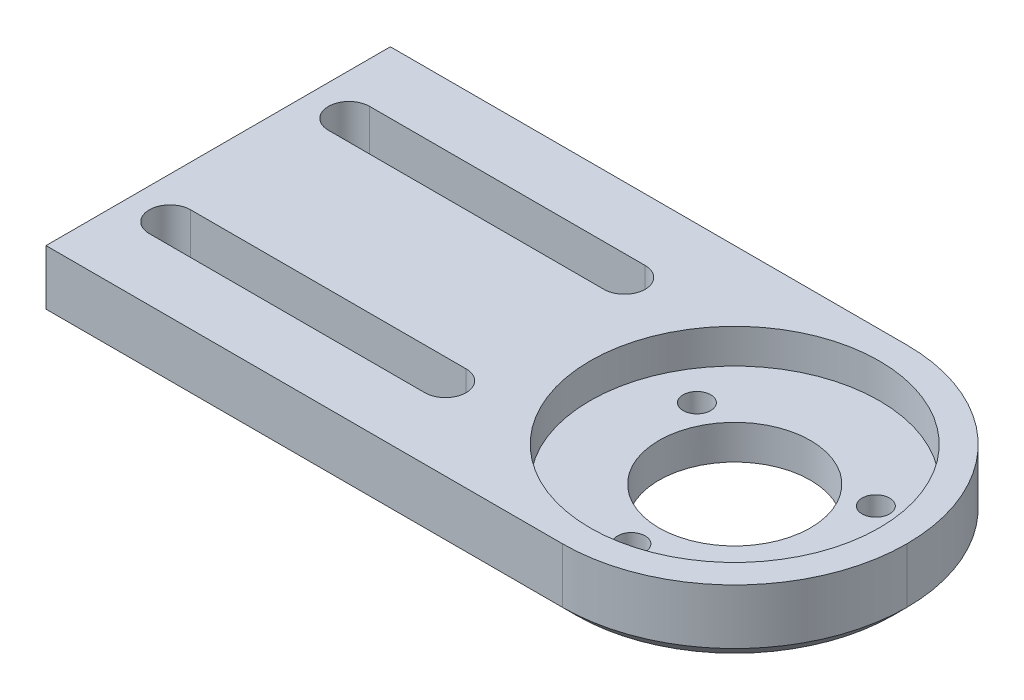
ISO-10303-21;
HEADER;
FILE_DESCRIPTION(('STEP AP214'),'2;1');
FILE_NAME('part.step','',(''),(''),'','','');
FILE_SCHEMA(('AUTOMOTIVE_DESIGN { 1 0 10303 214 1 1 1 1 }'));
ENDSEC;
DATA;
#1=APPLICATION_CONTEXT('core data for automotive mechanical design processes');
#2=APPLICATION_PROTOCOL_DEFINITION('international standard','automotive_design',2000,#1);
#3=PRODUCT_CONTEXT('',#1,'mechanical');
#4=PRODUCT('Part','Part','',(#3));
#5=PRODUCT_RELATED_PRODUCT_CATEGORY('part','',(#4));
#6=PRODUCT_DEFINITION_FORMATION('','',#4);
#7=PRODUCT_DEFINITION_CONTEXT('part definition',#1,'design');
#8=PRODUCT_DEFINITION('design','',#6,#7);
#9=PRODUCT_DEFINITION_SHAPE('','',#8);
#10=(LENGTH_UNIT() NAMED_UNIT(*) SI_UNIT(.MILLI.,.METRE.));
#11=(NAMED_UNIT(*) PLANE_ANGLE_UNIT() SI_UNIT($,.RADIAN.));
#12=(NAMED_UNIT(*) SI_UNIT($,.STERADIAN.) SOLID_ANGLE_UNIT());
#13=UNCERTAINTY_MEASURE_WITH_UNIT(LENGTH_MEASURE(1.E-05),#10,'distance_accuracy_value','');
#14=(GEOMETRIC_REPRESENTATION_CONTEXT(3) GLOBAL_UNCERTAINTY_ASSIGNED_CONTEXT((#13)) GLOBAL_UNIT_ASSIGNED_CONTEXT((#10,
#11,#12)) REPRESENTATION_CONTEXT('',''));
#15=CARTESIAN_POINT('',(0.,0.,0.));
#16=DIRECTION('',(0.,0.,1.));
#17=DIRECTION('',(1.,0.,0.));
#18=AXIS2_PLACEMENT_3D('',#15,#16,#17);
#19=CARTESIAN_POINT('',(0.,10.,0.));
#20=DIRECTION('',(0.,-1.,0.));
#21=DIRECTION('',(0.,0.,-1.));
#22=AXIS2_PLACEMENT_3D('',#19,#20,#21);
#23=PLANE('',#22);
#24=CARTESIAN_POINT('',(46.,10.,-38.));
#25=DIRECTION('',(0.,1.,0.));
#26=DIRECTION('',(0.,0.,1.));
#27=AXIS2_PLACEMENT_3D('',#24,#25,#26);
#28=CIRCLE('',#27,3.);
#29=CARTESIAN_POINT('',(46.,10.,-35.));
#30=VERTEX_POINT('',#29);
#31=CARTESIAN_POINT('',(46.,10.,-41.));
#32=VERTEX_POINT('',#31);
#33=EDGE_CURVE('E202',#30,#32,#28,.T.);
#34=ORIENTED_EDGE('',*,*,#33,.F.);
#35=DIRECTION('',(1.,0.,0.));
#36=VECTOR('',#35,1.);
#37=CARTESIAN_POINT('',(46.,10.,-35.));
#38=LINE('',#37,#36);
#39=CARTESIAN_POINT('',(6.,10.,-35.));
#40=VERTEX_POINT('',#39);
#41=EDGE_CURVE('E212',#40,#30,#38,.T.);
#42=ORIENTED_EDGE('',*,*,#41,.F.);
#43=CARTESIAN_POINT('',(6.,10.,-38.));
#44=DIRECTION('',(0.,1.,0.));
#45=DIRECTION('',(0.,0.,1.));
#46=AXIS2_PLACEMENT_3D('',#43,#44,#45);
#47=CIRCLE('',#46,3.);
#48=CARTESIAN_POINT('',(6.,10.,-41.));
#49=VERTEX_POINT('',#48);
#50=EDGE_CURVE('E208',#49,#40,#47,.T.);
#51=ORIENTED_EDGE('',*,*,#50,.F.);
#52=DIRECTION('',(-1.,0.,0.));
#53=VECTOR('',#52,1.);
#54=CARTESIAN_POINT('',(46.,10.,-41.));
#55=LINE('',#54,#53);
#56=EDGE_CURVE('E205',#32,#49,#55,.T.);
#57=ORIENTED_EDGE('',*,*,#56,.F.);
#58=EDGE_LOOP('',(#34,#42,#51,#57));
#59=FACE_BOUND('',#58,.T.);
#60=CARTESIAN_POINT('',(75.,10.,-25.));
#61=DIRECTION('',(0.,1.,0.));
#62=DIRECTION('',(0.,0.,1.));
#63=AXIS2_PLACEMENT_3D('',#60,#61,#62);
#64=CIRCLE('',#63,21.);
#65=CARTESIAN_POINT('',(75.,10.,-4.));
#66=VERTEX_POINT('',#65);
#67=EDGE_CURVE('E180',#66,#66,#64,.T.);
#68=ORIENTED_EDGE('',*,*,#67,.F.);
#69=EDGE_LOOP('',(#68));
#70=FACE_BOUND('',#69,.T.);
#71=CARTESIAN_POINT('',(75.,10.,-25.));
#72=DIRECTION('',(0.,-1.,0.));
#73=DIRECTION('',(0.,0.,-1.));
#74=AXIS2_PLACEMENT_3D('',#71,#72,#73);
#75=CIRCLE('',#74,25.);
#76=CARTESIAN_POINT('',(75.,10.,0.));
#77=VERTEX_POINT('',#76);
#78=CARTESIAN_POINT('',(100.,10.,-25.));
#79=VERTEX_POINT('',#78);
#80=EDGE_CURVE('E272',#77,#79,#75,.F.);
#81=ORIENTED_EDGE('',*,*,#80,.T.);
#82=CARTESIAN_POINT('',(75.,10.,-25.));
#83=DIRECTION('',(0.,-1.,0.));
#84=DIRECTION('',(0.,0.,-1.));
#85=AXIS2_PLACEMENT_3D('',#82,#83,#84);
#86=CIRCLE('',#85,25.);
#87=CARTESIAN_POINT('',(75.,10.,-50.));
#88=VERTEX_POINT('',#87);
#89=EDGE_CURVE('E275',#79,#88,#86,.F.);
#90=ORIENTED_EDGE('',*,*,#89,.T.);
#91=DIRECTION('',(-1.,0.,0.));
#92=VECTOR('',#91,1.);
#93=CARTESIAN_POINT('',(0.,10.,-50.));
#94=LINE('',#93,#92);
#95=CARTESIAN_POINT('',(0.,10.,-50.));
#96=VERTEX_POINT('',#95);
#97=EDGE_CURVE('E259',#88,#96,#94,.T.);
#98=ORIENTED_EDGE('',*,*,#97,.T.);
#99=DIRECTION('',(0.,0.,1.));
#100=VECTOR('',#99,1.);
#101=CARTESIAN_POINT('',(0.,10.,0.));
#102=LINE('',#101,#100);
#103=CARTESIAN_POINT('',(0.,10.,0.));
#104=VERTEX_POINT('',#103);
#105=EDGE_CURVE('E250',#96,#104,#102,.T.);
#106=ORIENTED_EDGE('',*,*,#105,.T.);
#107=DIRECTION('',(1.,0.,0.));
#108=VECTOR('',#107,1.);
#109=CARTESIAN_POINT('',(0.,10.,0.));
#110=LINE('',#109,#108);
#111=EDGE_CURVE('E254',#104,#77,#110,.T.);
#112=ORIENTED_EDGE('',*,*,#111,.T.);
#113=EDGE_LOOP('',(#81,#90,#98,#106,#112));
#114=FACE_BOUND('',#113,.T.);
#115=CARTESIAN_POINT('',(6.,10.,-12.));
#116=DIRECTION('',(0.,1.,0.));
#117=DIRECTION('',(0.,0.,1.));
#118=AXIS2_PLACEMENT_3D('',#115,#116,#117);
#119=CIRCLE('',#118,2.99999999999999);
#120=CARTESIAN_POINT('',(6.,10.,-15.));
#121=VERTEX_POINT('',#120);
#122=CARTESIAN_POINT('',(6.,10.,-9.00000000000001));
#123=VERTEX_POINT('',#122);
#124=EDGE_CURVE('E159',#121,#123,#119,.T.);
#125=ORIENTED_EDGE('',*,*,#124,.F.);
#126=DIRECTION('',(-1.,0.,0.));
#127=VECTOR('',#126,1.);
#128=CARTESIAN_POINT('',(6.,10.,-15.));
#129=LINE('',#128,#127);
#130=CARTESIAN_POINT('',(46.,10.,-15.));
#131=VERTEX_POINT('',#130);
#132=EDGE_CURVE('E189',#131,#121,#129,.T.);
#133=ORIENTED_EDGE('',*,*,#132,.F.);
#134=CARTESIAN_POINT('',(46.,10.,-12.));
#135=DIRECTION('',(0.,1.,0.));
#136=DIRECTION('',(0.,0.,1.));
#137=AXIS2_PLACEMENT_3D('',#134,#135,#136);
#138=CIRCLE('',#137,3.);
#139=CARTESIAN_POINT('',(46.,10.,-8.99999999999999));
#140=VERTEX_POINT('',#139);
#141=EDGE_CURVE('E185',#140,#131,#138,.T.);
#142=ORIENTED_EDGE('',*,*,#141,.F.);
#143=DIRECTION('',(1.,0.,0.));
#144=VECTOR('',#143,1.);
#145=CARTESIAN_POINT('',(6.,10.,-9.00000000000001));
#146=LINE('',#145,#144);
#147=EDGE_CURVE('E170',#123,#140,#146,.T.);
#148=ORIENTED_EDGE('',*,*,#147,.F.);
#149=EDGE_LOOP('',(#125,#133,#142,#148));
#150=FACE_BOUND('',#149,.T.);
#151=ADVANCED_FACE('F43',(#59,#70,#114,#150),#23,.F.);
#152=CARTESIAN_POINT('',(0.,0.,0.));
#153=DIRECTION('',(0.,-1.,0.));
#154=DIRECTION('',(0.,0.,-1.));
#155=AXIS2_PLACEMENT_3D('',#152,#153,#154);
#156=PLANE('',#155);
#157=CARTESIAN_POINT('',(75.,0.,-25.));
#158=DIRECTION('',(0.,-1.,0.));
#159=DIRECTION('',(0.,0.,-1.));
#160=AXIS2_PLACEMENT_3D('',#157,#158,#159);
#161=CIRCLE('',#160,23.);
#162=CARTESIAN_POINT('',(98.,0.,-25.));
#163=VERTEX_POINT('',#162);
#164=CARTESIAN_POINT('',(75.,0.,-2.00000000000002));
#165=VERTEX_POINT('',#164);
#166=EDGE_CURVE('E343',#163,#165,#161,.T.);
#167=ORIENTED_EDGE('',*,*,#166,.T.);
#168=DIRECTION('',(-1.,0.,0.));
#169=VECTOR('',#168,1.);
#170=CARTESIAN_POINT('',(0.,0.,-2.00000000000002));
#171=LINE('',#170,#169);
#172=CARTESIAN_POINT('',(2.00000000000002,0.,-2.00000000000002));
#173=VERTEX_POINT('',#172);
#174=EDGE_CURVE('E346',#165,#173,#171,.T.);
#175=ORIENTED_EDGE('',*,*,#174,.T.);
#176=DIRECTION('',(0.,0.,-1.));
#177=VECTOR('',#176,1.);
#178=CARTESIAN_POINT('',(2.00000000000002,0.,-50.));
#179=LINE('',#178,#177);
#180=CARTESIAN_POINT('',(2.00000000000002,0.,-48.));
#181=VERTEX_POINT('',#180);
#182=EDGE_CURVE('E337',#173,#181,#179,.T.);
#183=ORIENTED_EDGE('',*,*,#182,.T.);
#184=DIRECTION('',(1.,0.,0.));
#185=VECTOR('',#184,1.);
#186=CARTESIAN_POINT('',(75.,0.,-48.));
#187=LINE('',#186,#185);
#188=CARTESIAN_POINT('',(75.,0.,-48.));
#189=VERTEX_POINT('',#188);
#190=EDGE_CURVE('E334',#181,#189,#187,.T.);
#191=ORIENTED_EDGE('',*,*,#190,.T.);
#192=CARTESIAN_POINT('',(75.,0.,-25.));
#193=DIRECTION('',(0.,-1.,0.));
#194=DIRECTION('',(0.,0.,-1.));
#195=AXIS2_PLACEMENT_3D('',#192,#193,#194);
#196=CIRCLE('',#195,23.);
#197=EDGE_CURVE('E340',#189,#163,#196,.T.);
#198=ORIENTED_EDGE('',*,*,#197,.T.);
#199=EDGE_LOOP('',(#167,#175,#183,#191,#198));
#200=FACE_BOUND('',#199,.T.);
#201=CARTESIAN_POINT('',(87.9903810567666,0.,-32.5));
#202=DIRECTION('',(0.,-1.,0.));
#203=DIRECTION('',(0.,0.,-1.));
#204=AXIS2_PLACEMENT_3D('',#201,#202,#203);
#205=CIRCLE('',#204,1.99999999999998);
#206=CARTESIAN_POINT('',(87.9903810567666,0.,-34.5));
#207=VERTEX_POINT('',#206);
#208=EDGE_CURVE('E284',#207,#207,#205,.F.);
#209=ORIENTED_EDGE('',*,*,#208,.T.);
#210=EDGE_LOOP('',(#209));
#211=FACE_BOUND('',#210,.T.);
#212=CARTESIAN_POINT('',(62.0096189432334,0.,-32.5));
#213=DIRECTION('',(0.,-1.,0.));
#214=DIRECTION('',(0.,0.,-1.));
#215=AXIS2_PLACEMENT_3D('',#212,#213,#214);
#216=CIRCLE('',#215,1.99999999999997);
#217=CARTESIAN_POINT('',(62.0096189432334,0.,-34.5));
#218=VERTEX_POINT('',#217);
#219=EDGE_CURVE('E292',#218,#218,#216,.F.);
#220=ORIENTED_EDGE('',*,*,#219,.T.);
#221=EDGE_LOOP('',(#220));
#222=FACE_BOUND('',#221,.T.);
#223=CARTESIAN_POINT('',(75.,0.,-10.));
#224=DIRECTION('',(0.,-1.,0.));
#225=DIRECTION('',(0.,0.,-1.));
#226=AXIS2_PLACEMENT_3D('',#223,#224,#225);
#227=CIRCLE('',#226,2.);
#228=CARTESIAN_POINT('',(75.,0.,-12.));
#229=VERTEX_POINT('',#228);
#230=EDGE_CURVE('E288',#229,#229,#227,.F.);
#231=ORIENTED_EDGE('',*,*,#230,.T.);
#232=EDGE_LOOP('',(#231));
#233=FACE_BOUND('',#232,.T.);
#234=CARTESIAN_POINT('',(75.,0.,-25.));
#235=DIRECTION('',(0.,-1.,0.));
#236=DIRECTION('',(0.,0.,-1.));
#237=AXIS2_PLACEMENT_3D('',#234,#235,#236);
#238=CIRCLE('',#237,11.);
#239=CARTESIAN_POINT('',(75.,0.,-36.));
#240=VERTEX_POINT('',#239);
#241=EDGE_CURVE('E249',#240,#240,#238,.F.);
#242=ORIENTED_EDGE('',*,*,#241,.T.);
#243=EDGE_LOOP('',(#242));
#244=FACE_BOUND('',#243,.T.);
#245=DIRECTION('',(1.,0.,0.));
#246=VECTOR('',#245,1.);
#247=CARTESIAN_POINT('',(0.,0.,-35.));
#248=LINE('',#247,#246);
#249=CARTESIAN_POINT('',(6.,0.,-35.));
#250=VERTEX_POINT('',#249);
#251=CARTESIAN_POINT('',(46.,0.,-35.));
#252=VERTEX_POINT('',#251);
#253=EDGE_CURVE('E281',#250,#252,#248,.T.);
#254=ORIENTED_EDGE('',*,*,#253,.T.);
#255=CARTESIAN_POINT('',(46.,0.,-38.));
#256=DIRECTION('',(0.,-1.,0.));
#257=DIRECTION('',(0.,0.,-1.));
#258=AXIS2_PLACEMENT_3D('',#255,#256,#257);
#259=CIRCLE('',#258,3.);
#260=CARTESIAN_POINT('',(46.,0.,-41.));
#261=VERTEX_POINT('',#260);
#262=EDGE_CURVE('E313',#252,#261,#259,.F.);
#263=ORIENTED_EDGE('',*,*,#262,.T.);
#264=DIRECTION('',(1.,0.,0.));
#265=VECTOR('',#264,1.);
#266=CARTESIAN_POINT('',(0.,0.,-41.));
#267=LINE('',#266,#265);
#268=CARTESIAN_POINT('',(6.,0.,-41.));
#269=VERTEX_POINT('',#268);
#270=EDGE_CURVE('E309',#261,#269,#267,.F.);
#271=ORIENTED_EDGE('',*,*,#270,.T.);
#272=CARTESIAN_POINT('',(6.,0.,-38.));
#273=DIRECTION('',(0.,-1.,0.));
#274=DIRECTION('',(0.,0.,-1.));
#275=AXIS2_PLACEMENT_3D('',#272,#273,#274);
#276=CIRCLE('',#275,3.);
#277=EDGE_CURVE('E305',#269,#250,#276,.F.);
#278=ORIENTED_EDGE('',*,*,#277,.T.);
#279=EDGE_LOOP('',(#254,#263,#271,#278));
#280=FACE_BOUND('',#279,.T.);
#281=DIRECTION('',(1.,0.,0.));
#282=VECTOR('',#281,1.);
#283=CARTESIAN_POINT('',(0.,0.,-15.));
#284=LINE('',#283,#282);
#285=CARTESIAN_POINT('',(46.,0.,-15.));
#286=VERTEX_POINT('',#285);
#287=CARTESIAN_POINT('',(6.,0.,-15.));
#288=VERTEX_POINT('',#287);
#289=EDGE_CURVE('E317',#286,#288,#284,.F.);
#290=ORIENTED_EDGE('',*,*,#289,.T.);
#291=CARTESIAN_POINT('',(6.,0.,-12.));
#292=DIRECTION('',(0.,-1.,0.));
#293=DIRECTION('',(0.,0.,-1.));
#294=AXIS2_PLACEMENT_3D('',#291,#292,#293);
#295=CIRCLE('',#294,2.99999999999999);
#296=CARTESIAN_POINT('',(6.,0.,-9.00000000000001));
#297=VERTEX_POINT('',#296);
#298=EDGE_CURVE('E327',#288,#297,#295,.F.);
#299=ORIENTED_EDGE('',*,*,#298,.T.);
#300=DIRECTION('',(1.,0.,0.));
#301=VECTOR('',#300,1.);
#302=CARTESIAN_POINT('',(0.,0.,-9.00000000000001));
#303=LINE('',#302,#301);
#304=CARTESIAN_POINT('',(46.,0.,-9.));
#305=VERTEX_POINT('',#304);
#306=EDGE_CURVE('E178',#297,#305,#303,.T.);
#307=ORIENTED_EDGE('',*,*,#306,.T.);
#308=CARTESIAN_POINT('',(46.,0.,-12.));
#309=DIRECTION('',(0.,-1.,0.));
#310=DIRECTION('',(0.,0.,-1.));
#311=AXIS2_PLACEMENT_3D('',#308,#309,#310);
#312=CIRCLE('',#311,3.);
#313=EDGE_CURVE('E321',#305,#286,#312,.F.);
#314=ORIENTED_EDGE('',*,*,#313,.T.);
#315=EDGE_LOOP('',(#290,#299,#307,#314));
#316=FACE_BOUND('',#315,.T.);
#317=ADVANCED_FACE('F410',(#200,#211,#222,#233,#244,#280,#316),#156,.T.);
#318=CARTESIAN_POINT('',(75.,10.,-25.));
#319=DIRECTION('',(0.,-1.,0.));
#320=DIRECTION('',(0.,0.,-1.));
#321=AXIS2_PLACEMENT_3D('',#318,#319,#320);
#322=CYLINDRICAL_SURFACE('',#321,11.);
#323=ORIENTED_EDGE('',*,*,#241,.F.);
#324=EDGE_LOOP('',(#323));
#325=FACE_BOUND('',#324,.T.);
#326=CARTESIAN_POINT('',(75.,5.,-25.));
#327=DIRECTION('',(0.,1.,0.));
#328=DIRECTION('',(0.,0.,1.));
#329=AXIS2_PLACEMENT_3D('',#326,#327,#328);
#330=CIRCLE('',#329,11.);
#331=CARTESIAN_POINT('',(75.,5.,-14.));
#332=VERTEX_POINT('',#331);
#333=EDGE_CURVE('E245',#332,#332,#330,.T.);
#334=ORIENTED_EDGE('',*,*,#333,.T.);
#335=EDGE_LOOP('',(#334));
#336=FACE_BOUND('',#335,.T.);
#337=ADVANCED_FACE('F416',(#325,#336),#322,.F.);
#338=CARTESIAN_POINT('',(75.,10.,-10.));
#339=DIRECTION('',(0.,-1.,0.));
#340=DIRECTION('',(0.,0.,-1.));
#341=AXIS2_PLACEMENT_3D('',#338,#339,#340);
#342=CYLINDRICAL_SURFACE('',#341,2.);
#343=ORIENTED_EDGE('',*,*,#230,.F.);
#344=EDGE_LOOP('',(#343));
#345=FACE_BOUND('',#344,.T.);
#346=CARTESIAN_POINT('',(75.,5.,-10.));
#347=DIRECTION('',(0.,1.,0.));
#348=DIRECTION('',(0.,0.,1.));
#349=AXIS2_PLACEMENT_3D('',#346,#347,#348);
#350=CIRCLE('',#349,2.);
#351=CARTESIAN_POINT('',(75.,5.,-8.00000000000001));
#352=VERTEX_POINT('',#351);
#353=EDGE_CURVE('E241',#352,#352,#350,.T.);
#354=ORIENTED_EDGE('',*,*,#353,.T.);
#355=EDGE_LOOP('',(#354));
#356=FACE_BOUND('',#355,.T.);
#357=ADVANCED_FACE('F423',(#345,#356),#342,.F.);
#358=CARTESIAN_POINT('',(62.0096189432334,10.,-32.5));
#359=DIRECTION('',(0.,-1.,0.));
#360=DIRECTION('',(0.,0.,-1.));
#361=AXIS2_PLACEMENT_3D('',#358,#359,#360);
#362=CYLINDRICAL_SURFACE('',#361,1.99999999999997);
#363=ORIENTED_EDGE('',*,*,#219,.F.);
#364=EDGE_LOOP('',(#363));
#365=FACE_BOUND('',#364,.T.);
#366=CARTESIAN_POINT('',(62.0096189432334,5.,-32.5));
#367=DIRECTION('',(0.,1.,0.));
#368=DIRECTION('',(0.,0.,1.));
#369=AXIS2_PLACEMENT_3D('',#366,#367,#368);
#370=CIRCLE('',#369,1.99999999999997);
#371=CARTESIAN_POINT('',(62.0096189432334,5.,-30.5));
#372=VERTEX_POINT('',#371);
#373=EDGE_CURVE('E237',#372,#372,#370,.T.);
#374=ORIENTED_EDGE('',*,*,#373,.T.);
#375=EDGE_LOOP('',(#374));
#376=FACE_BOUND('',#375,.T.);
#377=ADVANCED_FACE('F428',(#365,#376),#362,.F.);
#378=CARTESIAN_POINT('',(87.9903810567666,10.,-32.5));
#379=DIRECTION('',(0.,-1.,0.));
#380=DIRECTION('',(0.,0.,-1.));
#381=AXIS2_PLACEMENT_3D('',#378,#379,#380);
#382=CYLINDRICAL_SURFACE('',#381,1.99999999999998);
#383=ORIENTED_EDGE('',*,*,#208,.F.);
#384=EDGE_LOOP('',(#383));
#385=FACE_BOUND('',#384,.T.);
#386=CARTESIAN_POINT('',(87.9903810567666,5.,-32.5));
#387=DIRECTION('',(0.,1.,0.));
#388=DIRECTION('',(0.,0.,1.));
#389=AXIS2_PLACEMENT_3D('',#386,#387,#388);
#390=CIRCLE('',#389,1.99999999999998);
#391=CARTESIAN_POINT('',(87.9903810567666,5.,-30.5));
#392=VERTEX_POINT('',#391);
#393=EDGE_CURVE('E233',#392,#392,#390,.T.);
#394=ORIENTED_EDGE('',*,*,#393,.T.);
#395=EDGE_LOOP('',(#394));
#396=FACE_BOUND('',#395,.T.);
#397=ADVANCED_FACE('F425',(#385,#396),#382,.F.);
#398=CARTESIAN_POINT('',(0.,10.,0.));
#399=DIRECTION('',(1.,0.,0.));
#400=DIRECTION('',(0.,0.,-1.));
#401=AXIS2_PLACEMENT_3D('',#398,#399,#400);
#402=PLANE('',#401);
#403=DIRECTION('',(0.,-1.,0.));
#404=VECTOR('',#403,1.);
#405=CARTESIAN_POINT('',(0.,10.,-50.));
#406=LINE('',#405,#404);
#407=CARTESIAN_POINT('',(0.,2.00000000000002,-50.));
#408=VERTEX_POINT('',#407);
#409=EDGE_CURVE('E262',#96,#408,#406,.T.);
#410=ORIENTED_EDGE('',*,*,#409,.T.);
#411=DIRECTION('',(0.,0.,1.));
#412=VECTOR('',#411,1.);
#413=CARTESIAN_POINT('',(0.,2.00000000000002,0.));
#414=LINE('',#413,#412);
#415=CARTESIAN_POINT('',(0.,2.00000000000002,0.));
#416=VERTEX_POINT('',#415);
#417=EDGE_CURVE('E54',#408,#416,#414,.T.);
#418=ORIENTED_EDGE('',*,*,#417,.T.);
#419=DIRECTION('',(0.,-1.,0.));
#420=VECTOR('',#419,1.);
#421=CARTESIAN_POINT('',(0.,10.,0.));
#422=LINE('',#421,#420);
#423=EDGE_CURVE('E265',#104,#416,#422,.T.);
#424=ORIENTED_EDGE('',*,*,#423,.F.);
#425=ORIENTED_EDGE('',*,*,#105,.F.);
#426=EDGE_LOOP('',(#410,#418,#424,#425));
#427=FACE_BOUND('',#426,.T.);
#428=ADVANCED_FACE('F387',(#427),#402,.F.);
#429=CARTESIAN_POINT('',(0.,10.,0.));
#430=DIRECTION('',(0.,0.,-1.));
#431=DIRECTION('',(-1.,0.,0.));
#432=AXIS2_PLACEMENT_3D('',#429,#430,#431);
#433=PLANE('',#432);
#434=ORIENTED_EDGE('',*,*,#423,.T.);
#435=DIRECTION('',(1.,0.,0.));
#436=VECTOR('',#435,1.);
#437=CARTESIAN_POINT('',(75.,2.00000000000002,0.));
#438=LINE('',#437,#436);
#439=CARTESIAN_POINT('',(75.,2.00000000000002,0.));
#440=VERTEX_POINT('',#439);
#441=EDGE_CURVE('E330',#416,#440,#438,.T.);
#442=ORIENTED_EDGE('',*,*,#441,.T.);
#443=DIRECTION('',(0.,-1.,0.));
#444=VECTOR('',#443,1.);
#445=CARTESIAN_POINT('',(75.,10.,0.));
#446=LINE('',#445,#444);
#447=EDGE_CURVE('E278',#440,#77,#446,.F.);
#448=ORIENTED_EDGE('',*,*,#447,.T.);
#449=ORIENTED_EDGE('',*,*,#111,.F.);
#450=EDGE_LOOP('',(#434,#442,#448,#449));
#451=FACE_BOUND('',#450,.T.);
#452=ADVANCED_FACE('F390',(#451),#433,.F.);
#453=CARTESIAN_POINT('',(0.,10.,-50.));
#454=DIRECTION('',(0.,0.,1.));
#455=DIRECTION('',(1.,0.,0.));
#456=AXIS2_PLACEMENT_3D('',#453,#454,#455);
#457=PLANE('',#456);
#458=DIRECTION('',(0.,-1.,0.));
#459=VECTOR('',#458,1.);
#460=CARTESIAN_POINT('',(75.,10.,-50.));
#461=LINE('',#460,#459);
#462=CARTESIAN_POINT('',(75.,2.00000000000002,-50.));
#463=VERTEX_POINT('',#462);
#464=EDGE_CURVE('E269',#88,#463,#461,.T.);
#465=ORIENTED_EDGE('',*,*,#464,.T.);
#466=DIRECTION('',(-1.,0.,0.));
#467=VECTOR('',#466,1.);
#468=CARTESIAN_POINT('',(0.,2.00000000000002,-50.));
#469=LINE('',#468,#467);
#470=EDGE_CURVE('E11',#463,#408,#469,.T.);
#471=ORIENTED_EDGE('',*,*,#470,.T.);
#472=ORIENTED_EDGE('',*,*,#409,.F.);
#473=ORIENTED_EDGE('',*,*,#97,.F.);
#474=EDGE_LOOP('',(#465,#471,#472,#473));
#475=FACE_BOUND('',#474,.T.);
#476=ADVANCED_FACE('F396',(#475),#457,.F.);
#477=CARTESIAN_POINT('',(75.,10.,-25.));
#478=DIRECTION('',(0.,-1.,0.));
#479=DIRECTION('',(0.,0.,-1.));
#480=AXIS2_PLACEMENT_3D('',#477,#478,#479);
#481=CYLINDRICAL_SURFACE('',#480,25.);
#482=ORIENTED_EDGE('',*,*,#447,.F.);
#483=CARTESIAN_POINT('',(75.,2.00000000000002,-25.));
#484=DIRECTION('',(0.,-1.,0.));
#485=DIRECTION('',(0.,0.,-1.));
#486=AXIS2_PLACEMENT_3D('',#483,#484,#485);
#487=CIRCLE('',#486,25.);
#488=CARTESIAN_POINT('',(100.,2.00000000000002,-25.));
#489=VERTEX_POINT('',#488);
#490=EDGE_CURVE('E350',#440,#489,#487,.F.);
#491=ORIENTED_EDGE('',*,*,#490,.T.);
#492=DIRECTION('',(0.,-1.,0.));
#493=VECTOR('',#492,1.);
#494=CARTESIAN_POINT('',(100.,10.,-25.));
#495=LINE('',#494,#493);
#496=EDGE_CURVE('E255',#79,#489,#495,.T.);
#497=ORIENTED_EDGE('',*,*,#496,.F.);
#498=ORIENTED_EDGE('',*,*,#80,.F.);
#499=EDGE_LOOP('',(#482,#491,#497,#498));
#500=FACE_BOUND('',#499,.T.);
#501=ADVANCED_FACE('F398',(#500),#481,.T.);
#502=CARTESIAN_POINT('',(75.,10.,-25.));
#503=DIRECTION('',(0.,-1.,0.));
#504=DIRECTION('',(0.,0.,-1.));
#505=AXIS2_PLACEMENT_3D('',#502,#503,#504);
#506=CYLINDRICAL_SURFACE('',#505,25.);
#507=ORIENTED_EDGE('',*,*,#496,.T.);
#508=CARTESIAN_POINT('',(75.,2.00000000000002,-25.));
#509=DIRECTION('',(0.,-1.,0.));
#510=DIRECTION('',(0.,0.,-1.));
#511=AXIS2_PLACEMENT_3D('',#508,#509,#510);
#512=CIRCLE('',#511,25.);
#513=EDGE_CURVE('E68',#489,#463,#512,.F.);
#514=ORIENTED_EDGE('',*,*,#513,.T.);
#515=ORIENTED_EDGE('',*,*,#464,.F.);
#516=ORIENTED_EDGE('',*,*,#89,.F.);
#517=EDGE_LOOP('',(#507,#514,#515,#516));
#518=FACE_BOUND('',#517,.T.);
#519=ADVANCED_FACE('F404',(#518),#506,.T.);
#520=CARTESIAN_POINT('',(75.,5.,-25.));
#521=DIRECTION('',(0.,1.,0.));
#522=DIRECTION('',(0.,0.,1.));
#523=AXIS2_PLACEMENT_3D('',#520,#521,#522);
#524=CYLINDRICAL_SURFACE('',#523,21.);
#525=CARTESIAN_POINT('',(75.,5.,-25.));
#526=DIRECTION('',(0.,1.,0.));
#527=DIRECTION('',(0.,0.,1.));
#528=AXIS2_PLACEMENT_3D('',#525,#526,#527);
#529=CIRCLE('',#528,21.);
#530=CARTESIAN_POINT('',(75.,5.,-4.));
#531=VERTEX_POINT('',#530);
#532=EDGE_CURVE('E229',#531,#531,#529,.T.);
#533=ORIENTED_EDGE('',*,*,#532,.F.);
#534=EDGE_LOOP('',(#533));
#535=FACE_BOUND('',#534,.T.);
#536=ORIENTED_EDGE('',*,*,#67,.T.);
#537=EDGE_LOOP('',(#536));
#538=FACE_BOUND('',#537,.T.);
#539=ADVANCED_FACE('F436',(#535,#538),#524,.F.);
#540=CARTESIAN_POINT('',(75.,5.,-25.));
#541=DIRECTION('',(0.,1.,0.));
#542=DIRECTION('',(0.,0.,1.));
#543=AXIS2_PLACEMENT_3D('',#540,#541,#542);
#544=PLANE('',#543);
#545=ORIENTED_EDGE('',*,*,#333,.F.);
#546=EDGE_LOOP('',(#545));
#547=FACE_BOUND('',#546,.T.);
#548=ORIENTED_EDGE('',*,*,#353,.F.);
#549=EDGE_LOOP('',(#548));
#550=FACE_BOUND('',#549,.T.);
#551=ORIENTED_EDGE('',*,*,#373,.F.);
#552=EDGE_LOOP('',(#551));
#553=FACE_BOUND('',#552,.T.);
#554=ORIENTED_EDGE('',*,*,#393,.F.);
#555=EDGE_LOOP('',(#554));
#556=FACE_BOUND('',#555,.T.);
#557=ORIENTED_EDGE('',*,*,#532,.T.);
#558=EDGE_LOOP('',(#557));
#559=FACE_BOUND('',#558,.T.);
#560=ADVANCED_FACE('F439',(#547,#550,#553,#556,#559),#544,.T.);
#561=CARTESIAN_POINT('',(46.,10.,-38.));
#562=DIRECTION('',(0.,-1.,0.));
#563=DIRECTION('',(0.,0.,-1.));
#564=AXIS2_PLACEMENT_3D('',#561,#562,#563);
#565=CYLINDRICAL_SURFACE('',#564,3.);
#566=DIRECTION('',(0.,-1.,0.));
#567=VECTOR('',#566,1.);
#568=CARTESIAN_POINT('',(46.,10.,-35.));
#569=LINE('',#568,#567);
#570=EDGE_CURVE('E215',#30,#252,#569,.T.);
#571=ORIENTED_EDGE('',*,*,#570,.F.);
#572=ORIENTED_EDGE('',*,*,#33,.T.);
#573=DIRECTION('',(0.,-1.,0.));
#574=VECTOR('',#573,1.);
#575=CARTESIAN_POINT('',(46.,10.,-41.));
#576=LINE('',#575,#574);
#577=EDGE_CURVE('E171',#32,#261,#576,.T.);
#578=ORIENTED_EDGE('',*,*,#577,.T.);
#579=ORIENTED_EDGE('',*,*,#262,.F.);
#580=EDGE_LOOP('',(#571,#572,#578,#579));
#581=FACE_BOUND('',#580,.T.);
#582=ADVANCED_FACE('F443',(#581),#565,.F.);
#583=CARTESIAN_POINT('',(46.,10.,-41.));
#584=DIRECTION('',(0.,0.,1.));
#585=DIRECTION('',(1.,0.,0.));
#586=AXIS2_PLACEMENT_3D('',#583,#584,#585);
#587=PLANE('',#586);
#588=ORIENTED_EDGE('',*,*,#577,.F.);
#589=ORIENTED_EDGE('',*,*,#56,.T.);
#590=DIRECTION('',(0.,-1.,0.));
#591=VECTOR('',#590,1.);
#592=CARTESIAN_POINT('',(6.,10.,-41.));
#593=LINE('',#592,#591);
#594=EDGE_CURVE('E219',#49,#269,#593,.T.);
#595=ORIENTED_EDGE('',*,*,#594,.T.);
#596=ORIENTED_EDGE('',*,*,#270,.F.);
#597=EDGE_LOOP('',(#588,#589,#595,#596));
#598=FACE_BOUND('',#597,.T.);
#599=ADVANCED_FACE('F447',(#598),#587,.T.);
#600=CARTESIAN_POINT('',(6.,10.,-38.));
#601=DIRECTION('',(0.,-1.,0.));
#602=DIRECTION('',(0.,0.,-1.));
#603=AXIS2_PLACEMENT_3D('',#600,#601,#602);
#604=CYLINDRICAL_SURFACE('',#603,3.);
#605=ORIENTED_EDGE('',*,*,#594,.F.);
#606=ORIENTED_EDGE('',*,*,#50,.T.);
#607=DIRECTION('',(0.,-1.,0.));
#608=VECTOR('',#607,1.);
#609=CARTESIAN_POINT('',(6.,10.,-35.));
#610=LINE('',#609,#608);
#611=EDGE_CURVE('E223',#40,#250,#610,.T.);
#612=ORIENTED_EDGE('',*,*,#611,.T.);
#613=ORIENTED_EDGE('',*,*,#277,.F.);
#614=EDGE_LOOP('',(#605,#606,#612,#613));
#615=FACE_BOUND('',#614,.T.);
#616=ADVANCED_FACE('F451',(#615),#604,.F.);
#617=CARTESIAN_POINT('',(46.,10.,-35.));
#618=DIRECTION('',(0.,0.,-1.));
#619=DIRECTION('',(-1.,0.,0.));
#620=AXIS2_PLACEMENT_3D('',#617,#618,#619);
#621=PLANE('',#620);
#622=ORIENTED_EDGE('',*,*,#611,.F.);
#623=ORIENTED_EDGE('',*,*,#41,.T.);
#624=ORIENTED_EDGE('',*,*,#570,.T.);
#625=ORIENTED_EDGE('',*,*,#253,.F.);
#626=EDGE_LOOP('',(#622,#623,#624,#625));
#627=FACE_BOUND('',#626,.T.);
#628=ADVANCED_FACE('F455',(#627),#621,.T.);
#629=CARTESIAN_POINT('',(6.,10.,-12.));
#630=DIRECTION('',(0.,-1.,0.));
#631=DIRECTION('',(0.,0.,-1.));
#632=AXIS2_PLACEMENT_3D('',#629,#630,#631);
#633=CYLINDRICAL_SURFACE('',#632,2.99999999999999);
#634=DIRECTION('',(0.,-1.,0.));
#635=VECTOR('',#634,1.);
#636=CARTESIAN_POINT('',(6.,10.,-15.));
#637=LINE('',#636,#635);
#638=EDGE_CURVE('E165',#121,#288,#637,.T.);
#639=ORIENTED_EDGE('',*,*,#638,.F.);
#640=ORIENTED_EDGE('',*,*,#124,.T.);
#641=DIRECTION('',(0.,-1.,0.));
#642=VECTOR('',#641,1.);
#643=CARTESIAN_POINT('',(6.,10.,-9.00000000000001));
#644=LINE('',#643,#642);
#645=EDGE_CURVE('E163',#123,#297,#644,.T.);
#646=ORIENTED_EDGE('',*,*,#645,.T.);
#647=ORIENTED_EDGE('',*,*,#298,.F.);
#648=EDGE_LOOP('',(#639,#640,#646,#647));
#649=FACE_BOUND('',#648,.T.);
#650=ADVANCED_FACE('F161',(#649),#633,.F.);
#651=CARTESIAN_POINT('',(6.,10.,-9.00000000000001));
#652=DIRECTION('',(0.,0.,-1.));
#653=DIRECTION('',(-1.,0.,0.));
#654=AXIS2_PLACEMENT_3D('',#651,#652,#653);
#655=PLANE('',#654);
#656=ORIENTED_EDGE('',*,*,#645,.F.);
#657=ORIENTED_EDGE('',*,*,#147,.T.);
#658=DIRECTION('',(0.,-1.,0.));
#659=VECTOR('',#658,1.);
#660=CARTESIAN_POINT('',(46.,10.,-8.99999999999999));
#661=LINE('',#660,#659);
#662=EDGE_CURVE('E181',#140,#305,#661,.T.);
#663=ORIENTED_EDGE('',*,*,#662,.T.);
#664=ORIENTED_EDGE('',*,*,#306,.F.);
#665=EDGE_LOOP('',(#656,#657,#663,#664));
#666=FACE_BOUND('',#665,.T.);
#667=ADVANCED_FACE('F174',(#666),#655,.T.);
#668=CARTESIAN_POINT('',(46.,10.,-12.));
#669=DIRECTION('',(0.,-1.,0.));
#670=DIRECTION('',(0.,0.,-1.));
#671=AXIS2_PLACEMENT_3D('',#668,#669,#670);
#672=CYLINDRICAL_SURFACE('',#671,3.);
#673=ORIENTED_EDGE('',*,*,#662,.F.);
#674=ORIENTED_EDGE('',*,*,#141,.T.);
#675=DIRECTION('',(0.,-1.,0.));
#676=VECTOR('',#675,1.);
#677=CARTESIAN_POINT('',(46.,10.,-15.));
#678=LINE('',#677,#676);
#679=EDGE_CURVE('E196',#131,#286,#678,.T.);
#680=ORIENTED_EDGE('',*,*,#679,.T.);
#681=ORIENTED_EDGE('',*,*,#313,.F.);
#682=EDGE_LOOP('',(#673,#674,#680,#681));
#683=FACE_BOUND('',#682,.T.);
#684=ADVANCED_FACE('F464',(#683),#672,.F.);
#685=CARTESIAN_POINT('',(6.,10.,-15.));
#686=DIRECTION('',(0.,0.,1.));
#687=DIRECTION('',(1.,0.,0.));
#688=AXIS2_PLACEMENT_3D('',#685,#686,#687);
#689=PLANE('',#688);
#690=ORIENTED_EDGE('',*,*,#679,.F.);
#691=ORIENTED_EDGE('',*,*,#132,.T.);
#692=ORIENTED_EDGE('',*,*,#638,.T.);
#693=ORIENTED_EDGE('',*,*,#289,.F.);
#694=EDGE_LOOP('',(#690,#691,#692,#693));
#695=FACE_BOUND('',#694,.T.);
#696=ADVANCED_FACE('F467',(#695),#689,.T.);
#697=CARTESIAN_POINT('',(0.,2.00000000000002,-50.));
#698=DIRECTION('',(0.,-0.707106781186547,-0.707106781186547));
#699=DIRECTION('',(1.,0.,0.));
#700=AXIS2_PLACEMENT_3D('',#697,#698,#699);
#701=PLANE('',#700);
#702=DIRECTION('',(-0.577350269189626,0.577350269189626,-0.577350269189626));
#703=VECTOR('',#702,1.);
#704=CARTESIAN_POINT('',(0.,2.00000000000002,-50.));
#705=LINE('',#704,#703);
#706=EDGE_CURVE('E366',#408,#181,#705,.F.);
#707=ORIENTED_EDGE('',*,*,#706,.F.);
#708=ORIENTED_EDGE('',*,*,#470,.F.);
#709=DIRECTION('',(0.,0.707106781186547,-0.707106781186547));
#710=VECTOR('',#709,1.);
#711=CARTESIAN_POINT('',(75.,0.,-48.));
#712=LINE('',#711,#710);
#713=EDGE_CURVE('E48',#189,#463,#712,.T.);
#714=ORIENTED_EDGE('',*,*,#713,.F.);
#715=ORIENTED_EDGE('',*,*,#190,.F.);
#716=EDGE_LOOP('',(#707,#708,#714,#715));
#717=FACE_BOUND('',#716,.T.);
#718=ADVANCED_FACE('F46',(#717),#701,.T.);
#719=CARTESIAN_POINT('',(75.,0.,-25.));
#720=DIRECTION('',(0.,1.,0.));
#721=DIRECTION('',(0.,0.,1.));
#722=AXIS2_PLACEMENT_3D('',#719,#720,#721);
#723=CONICAL_SURFACE('',#722,23.,0.785398163397448);
#724=ORIENTED_EDGE('',*,*,#713,.T.);
#725=ORIENTED_EDGE('',*,*,#513,.F.);
#726=DIRECTION('',(0.707106781186545,0.70710678118655,0.));
#727=VECTOR('',#726,1.);
#728=CARTESIAN_POINT('',(98.,0.,-25.));
#729=LINE('',#728,#727);
#730=EDGE_CURVE('E363',#163,#489,#729,.T.);
#731=ORIENTED_EDGE('',*,*,#730,.F.);
#732=ORIENTED_EDGE('',*,*,#197,.F.);
#733=EDGE_LOOP('',(#724,#725,#731,#732));
#734=FACE_BOUND('',#733,.T.);
#735=ADVANCED_FACE('F378',(#734),#723,.T.);
#736=CARTESIAN_POINT('',(0.,2.00000000000002,0.));
#737=DIRECTION('',(-0.707106781186547,-0.707106781186547,0.));
#738=DIRECTION('',(0.,0.,-1.));
#739=AXIS2_PLACEMENT_3D('',#736,#737,#738);
#740=PLANE('',#739);
#741=ORIENTED_EDGE('',*,*,#706,.T.);
#742=ORIENTED_EDGE('',*,*,#182,.F.);
#743=DIRECTION('',(-0.577350269189626,0.577350269189626,0.577350269189626));
#744=VECTOR('',#743,1.);
#745=CARTESIAN_POINT('',(0.,2.00000000000002,0.));
#746=LINE('',#745,#744);
#747=EDGE_CURVE('E360',#416,#173,#746,.F.);
#748=ORIENTED_EDGE('',*,*,#747,.F.);
#749=ORIENTED_EDGE('',*,*,#417,.F.);
#750=EDGE_LOOP('',(#741,#742,#748,#749));
#751=FACE_BOUND('',#750,.T.);
#752=ADVANCED_FACE('F383',(#751),#740,.T.);
#753=CARTESIAN_POINT('',(75.,0.,-25.));
#754=DIRECTION('',(0.,1.,0.));
#755=DIRECTION('',(0.,0.,1.));
#756=AXIS2_PLACEMENT_3D('',#753,#754,#755);
#757=CONICAL_SURFACE('',#756,23.,0.78539816339745);
#758=ORIENTED_EDGE('',*,*,#730,.T.);
#759=ORIENTED_EDGE('',*,*,#490,.F.);
#760=DIRECTION('',(0.,0.707106781186546,0.707106781186549));
#761=VECTOR('',#760,1.);
#762=CARTESIAN_POINT('',(75.,0.,-2.00000000000002));
#763=LINE('',#762,#761);
#764=EDGE_CURVE('E357',#165,#440,#763,.T.);
#765=ORIENTED_EDGE('',*,*,#764,.F.);
#766=ORIENTED_EDGE('',*,*,#166,.F.);
#767=EDGE_LOOP('',(#758,#759,#765,#766));
#768=FACE_BOUND('',#767,.T.);
#769=ADVANCED_FACE('F481',(#768),#757,.T.);
#770=CARTESIAN_POINT('',(0.,2.00000000000002,0.));
#771=DIRECTION('',(0.,-0.707106781186547,0.707106781186547));
#772=DIRECTION('',(-1.,0.,0.));
#773=AXIS2_PLACEMENT_3D('',#770,#771,#772);
#774=PLANE('',#773);
#775=ORIENTED_EDGE('',*,*,#747,.T.);
#776=ORIENTED_EDGE('',*,*,#174,.F.);
#777=ORIENTED_EDGE('',*,*,#764,.T.);
#778=ORIENTED_EDGE('',*,*,#441,.F.);
#779=EDGE_LOOP('',(#775,#776,#777,#778));
#780=FACE_BOUND('',#779,.T.);
#781=ADVANCED_FACE('F496',(#780),#774,.T.);
#782=CLOSED_SHELL('',(#151,#317,#337,#357,#377,#397,#428,#452,#476,#501,#519,#539,#560,#582,
#599,#616,#628,#650,#667,#684,#696,#718,#735,#752,#769,#781));
#783=MANIFOLD_SOLID_BREP('B2',#782);
#784=ADVANCED_BREP_SHAPE_REPRESENTATION('',(#18,#783),#14);
#785=SHAPE_DEFINITION_REPRESENTATION(#9,#784);
ENDSEC;
END-ISO-10303-21;
